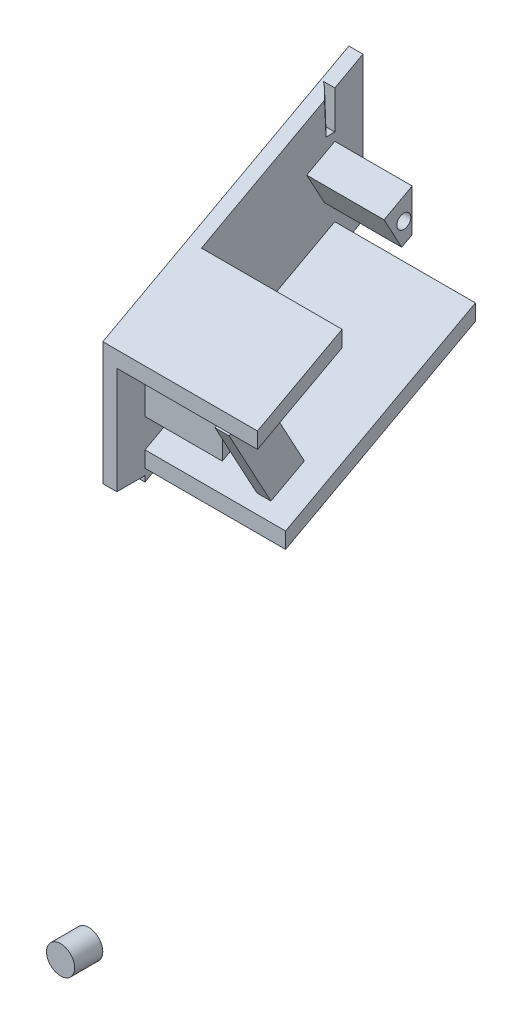
ISO-10303-21;
HEADER;
FILE_DESCRIPTION(('STEP AP214'),'2;1');
FILE_NAME('part.step','',(''),(''),'','','');
FILE_SCHEMA(('AUTOMOTIVE_DESIGN { 1 0 10303 214 1 1 1 1 }'));
ENDSEC;
DATA;
#1=APPLICATION_CONTEXT('core data for automotive mechanical design processes');
#2=APPLICATION_PROTOCOL_DEFINITION('international standard','automotive_design',2000,#1);
#3=PRODUCT_CONTEXT('',#1,'mechanical');
#4=PRODUCT('Part','Part','',(#3));
#5=PRODUCT_RELATED_PRODUCT_CATEGORY('part','',(#4));
#6=PRODUCT_DEFINITION_FORMATION('','',#4);
#7=PRODUCT_DEFINITION_CONTEXT('part definition',#1,'design');
#8=PRODUCT_DEFINITION('design','',#6,#7);
#9=PRODUCT_DEFINITION_SHAPE('','',#8);
#10=(LENGTH_UNIT() NAMED_UNIT(*) SI_UNIT(.MILLI.,.METRE.));
#11=(NAMED_UNIT(*) PLANE_ANGLE_UNIT() SI_UNIT($,.RADIAN.));
#12=(NAMED_UNIT(*) SI_UNIT($,.STERADIAN.) SOLID_ANGLE_UNIT());
#13=UNCERTAINTY_MEASURE_WITH_UNIT(LENGTH_MEASURE(1.E-05),#10,'distance_accuracy_value','');
#14=(GEOMETRIC_REPRESENTATION_CONTEXT(3) GLOBAL_UNCERTAINTY_ASSIGNED_CONTEXT((#13)) GLOBAL_UNIT_ASSIGNED_CONTEXT((#10,
#11,#12)) REPRESENTATION_CONTEXT('',''));
#15=CARTESIAN_POINT('',(0.,0.,0.));
#16=DIRECTION('',(0.,0.,1.));
#17=DIRECTION('',(1.,0.,0.));
#18=AXIS2_PLACEMENT_3D('',#15,#16,#17);
#19=CARTESIAN_POINT('',(8.,0.,7.));
#20=DIRECTION('',(-1.,0.,0.));
#21=DIRECTION('',(0.,-1.,0.));
#22=AXIS2_PLACEMENT_3D('',#19,#20,#21);
#23=PLANE('',#22);
#24=DIRECTION('',(0.,0.879716686463005,0.475498214043492));
#25=VECTOR('',#24,1.);
#26=CARTESIAN_POINT('',(8.00000000000001,95.1398047539169,26.7593521727643));
#27=LINE('',#26,#25);
#28=CARTESIAN_POINT('',(8.00000000000001,90.4963960632682,24.2495298930997));
#29=VERTEX_POINT('',#28);
#30=CARTESIAN_POINT('',(8.00000000000001,95.1398047539169,26.7593521727643));
#31=VERTEX_POINT('',#30);
#32=EDGE_CURVE('E684',#29,#31,#27,.T.);
#33=ORIENTED_EDGE('',*,*,#32,.F.);
#34=DIRECTION('',(0.,0.475498214043486,-0.879716686463009));
#35=VECTOR('',#34,1.);
#36=CARTESIAN_POINT('',(8.00000000000001,89.8306985636073,25.481133254148));
#37=LINE('',#36,#35);
#38=CARTESIAN_POINT('',(8.00000000000001,87.9287057074334,29.));
#39=VERTEX_POINT('',#38);
#40=EDGE_CURVE('E501',#39,#29,#37,.T.);
#41=ORIENTED_EDGE('',*,*,#40,.F.);
#42=DIRECTION('',(0.,-1.,0.));
#43=VECTOR('',#42,1.);
#44=CARTESIAN_POINT('',(8.00000000000001,93.9287057074334,29.));
#45=LINE('',#44,#43);
#46=CARTESIAN_POINT('',(8.00000000000001,93.9287057074334,29.));
#47=VERTEX_POINT('',#46);
#48=EDGE_CURVE('E495',#47,#39,#45,.T.);
#49=ORIENTED_EDGE('',*,*,#48,.F.);
#50=DIRECTION('',(0.,-0.475498214043486,0.879716686463008));
#51=VECTOR('',#50,1.);
#52=CARTESIAN_POINT('',(8.00000000000001,93.9287057074334,29.));
#53=LINE('',#52,#51);
#54=EDGE_CURVE('E490',#31,#47,#53,.T.);
#55=ORIENTED_EDGE('',*,*,#54,.F.);
#56=EDGE_LOOP('',(#33,#41,#49,#55));
#57=FACE_BOUND('',#56,.T.);
#58=DIRECTION('',(0.,-1.,0.));
#59=VECTOR('',#58,1.);
#60=CARTESIAN_POINT('',(8.00000000000001,83.8241456869468,29.));
#61=LINE('',#60,#59);
#62=CARTESIAN_POINT('',(8.00000000000001,83.8241456869468,29.));
#63=VERTEX_POINT('',#62);
#64=CARTESIAN_POINT('',(8.00000000000001,81.5506864803911,29.));
#65=VERTEX_POINT('',#64);
#66=EDGE_CURVE('E526',#63,#65,#61,.T.);
#67=ORIENTED_EDGE('',*,*,#66,.F.);
#68=DIRECTION('',(0.,-0.475498214043486,0.879716686463009));
#69=VECTOR('',#68,1.);
#70=CARTESIAN_POINT('',(8.00000000000001,83.8241456869468,29.));
#71=LINE('',#70,#69);
#72=CARTESIAN_POINT('',(8.00000000000001,98.4179938845892,2.));
#73=VERTEX_POINT('',#72);
#74=EDGE_CURVE('E542',#73,#63,#71,.T.);
#75=ORIENTED_EDGE('',*,*,#74,.F.);
#76=DIRECTION('',(0.,1.,0.));
#77=VECTOR('',#76,1.);
#78=CARTESIAN_POINT('',(8.00000000000001,96.1445346780335,2.));
#79=LINE('',#78,#77);
#80=CARTESIAN_POINT('',(8.00000000000001,96.1445346780335,2.));
#81=VERTEX_POINT('',#80);
#82=EDGE_CURVE('E537',#81,#73,#79,.T.);
#83=ORIENTED_EDGE('',*,*,#82,.F.);
#84=DIRECTION('',(0.,0.475498214043486,-0.879716686463009));
#85=VECTOR('',#84,1.);
#86=CARTESIAN_POINT('',(8.00000000000001,81.5506864803911,29.));
#87=LINE('',#86,#85);
#88=EDGE_CURVE('E532',#65,#81,#87,.T.);
#89=ORIENTED_EDGE('',*,*,#88,.F.);
#90=EDGE_LOOP('',(#67,#75,#83,#89));
#91=FACE_BOUND('',#90,.T.);
#92=DIRECTION('',(0.,1.,0.));
#93=VECTOR('',#92,1.);
#94=CARTESIAN_POINT('',(8.00000000000001,102.321671211559,2.));
#95=LINE('',#94,#93);
#96=CARTESIAN_POINT('',(8.00000000000001,102.321671211559,2.));
#97=VERTEX_POINT('',#96);
#98=CARTESIAN_POINT('',(8.00000000000001,108.321671211559,1.99999999999999));
#99=VERTEX_POINT('',#98);
#100=EDGE_CURVE('E463',#97,#99,#95,.T.);
#101=ORIENTED_EDGE('',*,*,#100,.F.);
#102=DIRECTION('',(0.,0.475498214043486,-0.879716686463008));
#103=VECTOR('',#102,1.);
#104=CARTESIAN_POINT('',(8.00000000000001,100.159619626723,6.));
#105=LINE('',#104,#103);
#106=CARTESIAN_POINT('',(8.00000000000001,101.516210936074,3.49017772033549));
#107=VERTEX_POINT('',#106);
#108=EDGE_CURVE('E457',#107,#97,#105,.T.);
#109=ORIENTED_EDGE('',*,*,#108,.F.);
#110=DIRECTION('',(0.,0.879716686463006,0.475498214043491));
#111=VECTOR('',#110,1.);
#112=CARTESIAN_POINT('',(8.00000000000001,106.159619626723,6.));
#113=LINE('',#112,#111);
#114=CARTESIAN_POINT('',(8.00000000000001,106.159619626723,6.));
#115=VERTEX_POINT('',#114);
#116=EDGE_CURVE('E710',#107,#115,#113,.T.);
#117=ORIENTED_EDGE('',*,*,#116,.T.);
#118=DIRECTION('',(0.,-0.475498214043486,0.879716686463008));
#119=VECTOR('',#118,1.);
#120=CARTESIAN_POINT('',(8.00000000000001,108.321671211559,2.));
#121=LINE('',#120,#119);
#122=EDGE_CURVE('E469',#99,#115,#121,.T.);
#123=ORIENTED_EDGE('',*,*,#122,.F.);
#124=EDGE_LOOP('',(#101,#109,#117,#123));
#125=FACE_BOUND('',#124,.T.);
#126=DIRECTION('',(0.,0.475498214043486,-0.879716686463008));
#127=VECTOR('',#126,1.);
#128=CARTESIAN_POINT('',(8.00000000000001,93.6227036654673,3.5));
#129=LINE('',#128,#127);
#130=CARTESIAN_POINT('',(8.00000000000001,79.8396248121383,29.));
#131=VERTEX_POINT('',#130);
#132=CARTESIAN_POINT('',(8.00000000000001,96.5955245946166,-2.));
#133=VERTEX_POINT('',#132);
#134=EDGE_CURVE('E368',#131,#133,#129,.T.);
#135=ORIENTED_EDGE('',*,*,#134,.T.);
#136=DIRECTION('',(0.,1.,0.));
#137=VECTOR('',#136,1.);
#138=CARTESIAN_POINT('',(8.00000000000001,93.6227036654673,-2.));
#139=LINE('',#138,#137);
#140=CARTESIAN_POINT('',(8.00000000000001,117.062624716954,-2.));
#141=VERTEX_POINT('',#140);
#142=EDGE_CURVE('E362',#133,#141,#139,.T.);
#143=ORIENTED_EDGE('',*,*,#142,.T.);
#144=DIRECTION('',(0.,-0.475498214043487,0.879716686463008));
#145=VECTOR('',#144,1.);
#146=CARTESIAN_POINT('',(8.00000000000001,89.7583274002542,48.5155335019852));
#147=LINE('',#146,#145);
#148=CARTESIAN_POINT('',(8.00000000000001,114.900573132118,2.));
#149=VERTEX_POINT('',#148);
#150=EDGE_CURVE('E345',#141,#149,#147,.T.);
#151=ORIENTED_EDGE('',*,*,#150,.T.);
#152=DIRECTION('',(0.,-1.,0.));
#153=VECTOR('',#152,1.);
#154=CARTESIAN_POINT('',(8.00000000000001,93.6227036654673,2.));
#155=LINE('',#154,#153);
#156=CARTESIAN_POINT('',(8.00000000000001,109.474229053552,2.));
#157=VERTEX_POINT('',#156);
#158=EDGE_CURVE('E370',#149,#157,#155,.T.);
#159=ORIENTED_EDGE('',*,*,#158,.T.);
#160=DIRECTION('',(0.,0.,1.));
#161=VECTOR('',#160,1.);
#162=CARTESIAN_POINT('',(8.,109.474229053552,2.));
#163=LINE('',#162,#161);
#164=CARTESIAN_POINT('',(8.,109.474229053552,3.25315614578327));
#165=VERTEX_POINT('',#164);
#166=EDGE_CURVE('E375',#157,#165,#163,.T.);
#167=ORIENTED_EDGE('',*,*,#166,.T.);
#168=CARTESIAN_POINT('',(8.,-75.1999200639359,10.));
#169=DIRECTION('',(-1.,0.,0.));
#170=DIRECTION('',(0.,1.,0.));
#171=AXIS2_PLACEMENT_3D('',#168,#169,#170);
#172=ELLIPSE('',#171,250.199920063936,10.);
#173=CARTESIAN_POINT('',(8.00000000000001,114.110535007947,3.46164528119833));
#174=VERTEX_POINT('',#173);
#175=EDGE_CURVE('E412',#165,#174,#172,.F.);
#176=ORIENTED_EDGE('',*,*,#175,.T.);
#177=CARTESIAN_POINT('',(8.00000000000001,104.650594806798,20.9634297298192));
#178=VERTEX_POINT('',#177);
#179=EDGE_CURVE('E357',#174,#178,#147,.T.);
#180=ORIENTED_EDGE('',*,*,#179,.T.);
#181=DIRECTION('',(0.,1.,0.));
#182=VECTOR('',#181,1.);
#183=CARTESIAN_POINT('',(8.00000000000001,102.377135600242,20.9634297298192));
#184=LINE('',#183,#182);
#185=CARTESIAN_POINT('',(8.00000000000001,102.377135600242,20.9634297298192));
#186=VERTEX_POINT('',#185);
#187=EDGE_CURVE('E575',#186,#178,#184,.T.);
#188=ORIENTED_EDGE('',*,*,#187,.F.);
#189=DIRECTION('',(0.,0.475498214043487,-0.879716686463008));
#190=VECTOR('',#189,1.);
#191=CARTESIAN_POINT('',(8.00000000000001,98.0332657279199,29.));
#192=LINE('',#191,#190);
#193=CARTESIAN_POINT('',(8.00000000000001,95.871214143084,33.));
#194=VERTEX_POINT('',#193);
#195=EDGE_CURVE('E570',#194,#186,#192,.T.);
#196=ORIENTED_EDGE('',*,*,#195,.F.);
#197=DIRECTION('',(0.,-1.,0.));
#198=VECTOR('',#197,1.);
#199=CARTESIAN_POINT('',(8.00000000000001,80.6503941564518,33.));
#200=LINE('',#199,#198);
#201=CARTESIAN_POINT('',(8.00000000000001,80.6503941564518,33.));
#202=VERTEX_POINT('',#201);
#203=EDGE_CURVE('E394',#194,#202,#200,.T.);
#204=ORIENTED_EDGE('',*,*,#203,.T.);
#205=DIRECTION('',(0.,0.,-1.));
#206=VECTOR('',#205,1.);
#207=CARTESIAN_POINT('',(8.00000000000001,80.6503941564518,29.));
#208=LINE('',#207,#206);
#209=CARTESIAN_POINT('',(8.00000000000001,80.6503941564518,29.));
#210=VERTEX_POINT('',#209);
#211=EDGE_CURVE('E377',#202,#210,#208,.T.);
#212=ORIENTED_EDGE('',*,*,#211,.T.);
#213=DIRECTION('',(0.,-1.,0.));
#214=VECTOR('',#213,1.);
#215=CARTESIAN_POINT('',(8.,0.,29.));
#216=LINE('',#215,#214);
#217=EDGE_CURVE('E371',#210,#131,#216,.T.);
#218=ORIENTED_EDGE('',*,*,#217,.T.);
#219=EDGE_LOOP('',(#135,#143,#151,#159,#167,#176,#180,#188,#196,#204,#212,#218));
#220=FACE_BOUND('',#219,.T.);
#221=ADVANCED_FACE('F146',(#57,#91,#125,#220),#23,.F.);
#222=CARTESIAN_POINT('',(5.00799041278211,-0.399680383488716,10.));
#223=DIRECTION('',(-0.0399680383488716,0.999200958721789,0.));
#224=DIRECTION('',(-0.999200958721789,-0.0399680383488716,0.));
#225=AXIS2_PLACEMENT_3D('',#222,#223,#224);
#226=CYLINDRICAL_SURFACE('',#225,10.);
#227=DIRECTION('',(-0.0399680383488716,0.999200958721789,0.));
#228=VECTOR('',#227,1.);
#229=CARTESIAN_POINT('',(11.0031961651129,-0.159872153395486,2.));
#230=LINE('',#229,#228);
#231=CARTESIAN_POINT('',(6.4007783536923,114.900573132118,2.));
#232=VERTEX_POINT('',#231);
#233=CARTESIAN_POINT('',(6.61783211683497,109.474229053552,2.));
#234=VERTEX_POINT('',#233);
#235=EDGE_CURVE('E381',#232,#234,#230,.F.);
#236=ORIENTED_EDGE('',*,*,#235,.F.);
#237=CARTESIAN_POINT('',(0.56894439894471,110.576469962446,10.));
#238=DIRECTION('',(0.,0.879716686463008,0.475498214043487));
#239=DIRECTION('',(-0.0838262150789779,0.4738246452998,-0.876620425938189));
#240=AXIS2_PLACEMENT_3D('',#237,#238,#239);
#241=ELLIPSE('',#240,11.3763862349771,10.);
#242=EDGE_CURVE('E657',#232,#174,#241,.F.);
#243=ORIENTED_EDGE('',*,*,#242,.T.);
#244=ORIENTED_EDGE('',*,*,#175,.F.);
#245=CARTESIAN_POINT('',(0.613034035300496,109.474229053552,10.));
#246=DIRECTION('',(0.,1.,0.));
#247=DIRECTION('',(-1.,0.,0.));
#248=AXIS2_PLACEMENT_3D('',#245,#246,#247);
#249=ELLIPSE('',#248,10.0079968025574,10.);
#250=EDGE_CURVE('E409',#234,#165,#249,.F.);
#251=ORIENTED_EDGE('',*,*,#250,.F.);
#252=EDGE_LOOP('',(#236,#243,#244,#251));
#253=FACE_BOUND('',#252,.T.);
#254=ADVANCED_FACE('F748',(#253),#226,.T.);
#255=CARTESIAN_POINT('',(0.,0.,29.));
#256=DIRECTION('',(0.,0.,1.));
#257=DIRECTION('',(1.,0.,0.));
#258=AXIS2_PLACEMENT_3D('',#255,#256,#257);
#259=PLANE('',#258);
#260=DIRECTION('',(0.,-1.,0.));
#261=VECTOR('',#260,1.);
#262=CARTESIAN_POINT('',(6.,31.5,29.));
#263=LINE('',#262,#261);
#264=CARTESIAN_POINT('',(6.00000000000001,80.6503941564518,29.));
#265=VERTEX_POINT('',#264);
#266=CARTESIAN_POINT('',(6.,79.8396248121384,29.));
#267=VERTEX_POINT('',#266);
#268=EDGE_CURVE('E411',#265,#267,#263,.T.);
#269=ORIENTED_EDGE('',*,*,#268,.T.);
#270=DIRECTION('',(1.,0.,0.));
#271=VECTOR('',#270,1.);
#272=CARTESIAN_POINT('',(0.,79.8396248121383,29.));
#273=LINE('',#272,#271);
#274=EDGE_CURVE('E654',#267,#131,#273,.T.);
#275=ORIENTED_EDGE('',*,*,#274,.T.);
#276=ORIENTED_EDGE('',*,*,#217,.F.);
#277=DIRECTION('',(1.,0.,0.));
#278=VECTOR('',#277,1.);
#279=CARTESIAN_POINT('',(6.00000000000001,80.6503941564518,29.));
#280=LINE('',#279,#278);
#281=EDGE_CURVE('E389',#265,#210,#280,.T.);
#282=ORIENTED_EDGE('',*,*,#281,.F.);
#283=EDGE_LOOP('',(#269,#275,#276,#282));
#284=FACE_BOUND('',#283,.T.);
#285=ADVANCED_FACE('F653',(#284),#259,.T.);
#286=CARTESIAN_POINT('',(6.,31.5,2.));
#287=DIRECTION('',(-1.,0.,0.));
#288=DIRECTION('',(0.,0.,1.));
#289=AXIS2_PLACEMENT_3D('',#286,#287,#288);
#290=PLANE('',#289);
#291=DIRECTION('',(0.,0.475498214043487,-0.879716686463008));
#292=VECTOR('',#291,1.);
#293=CARTESIAN_POINT('',(6.,96.0438243477936,36.8867694306296));
#294=LINE('',#293,#292);
#295=CARTESIAN_POINT('',(6.,98.1446733496397,33.));
#296=VERTEX_POINT('',#295);
#297=CARTESIAN_POINT('',(6.00000000000001,117.062624716954,-2.));
#298=VERTEX_POINT('',#297);
#299=EDGE_CURVE('E356',#296,#298,#294,.T.);
#300=ORIENTED_EDGE('',*,*,#299,.T.);
#301=DIRECTION('',(0.,1.,0.));
#302=VECTOR('',#301,1.);
#303=CARTESIAN_POINT('',(6.00000000000001,93.6227036654673,-2.));
#304=LINE('',#303,#302);
#305=CARTESIAN_POINT('',(6.00000000000001,96.5955245946166,-2.));
#306=VERTEX_POINT('',#305);
#307=EDGE_CURVE('E364',#306,#298,#304,.T.);
#308=ORIENTED_EDGE('',*,*,#307,.F.);
#309=DIRECTION('',(0.,0.475498214043486,-0.879716686463008));
#310=VECTOR('',#309,1.);
#311=CARTESIAN_POINT('',(6.00000000000001,93.6227036654673,3.5));
#312=LINE('',#311,#310);
#313=EDGE_CURVE('E162',#267,#306,#312,.T.);
#314=ORIENTED_EDGE('',*,*,#313,.F.);
#315=ORIENTED_EDGE('',*,*,#268,.F.);
#316=DIRECTION('',(0.,0.,-1.));
#317=VECTOR('',#316,1.);
#318=CARTESIAN_POINT('',(6.00000000000001,80.6503941564518,29.));
#319=LINE('',#318,#317);
#320=CARTESIAN_POINT('',(6.00000000000001,80.6503941564518,33.));
#321=VERTEX_POINT('',#320);
#322=EDGE_CURVE('E390',#321,#265,#319,.T.);
#323=ORIENTED_EDGE('',*,*,#322,.F.);
#324=DIRECTION('',(0.,-1.,0.));
#325=VECTOR('',#324,1.);
#326=CARTESIAN_POINT('',(6.00000000000001,80.6503941564518,33.));
#327=LINE('',#326,#325);
#328=EDGE_CURVE('E385',#296,#321,#327,.T.);
#329=ORIENTED_EDGE('',*,*,#328,.F.);
#330=EDGE_LOOP('',(#300,#308,#314,#315,#323,#329));
#331=FACE_BOUND('',#330,.T.);
#332=ADVANCED_FACE('F647',(#331),#290,.T.);
#333=CARTESIAN_POINT('',(6.00000000000001,80.6503941564518,33.));
#334=DIRECTION('',(0.,0.,1.));
#335=DIRECTION('',(1.,0.,0.));
#336=AXIS2_PLACEMENT_3D('',#333,#334,#335);
#337=PLANE('',#336);
#338=DIRECTION('',(-1.,0.,0.));
#339=VECTOR('',#338,1.);
#340=CARTESIAN_POINT('',(28.,98.1446733496397,33.));
#341=LINE('',#340,#339);
#342=CARTESIAN_POINT('',(28.,98.1446733496397,33.));
#343=VERTEX_POINT('',#342);
#344=EDGE_CURVE('E384',#343,#296,#341,.T.);
#345=ORIENTED_EDGE('',*,*,#344,.T.);
#346=ORIENTED_EDGE('',*,*,#328,.T.);
#347=DIRECTION('',(1.,0.,0.));
#348=VECTOR('',#347,1.);
#349=CARTESIAN_POINT('',(6.00000000000001,80.6503941564518,33.));
#350=LINE('',#349,#348);
#351=EDGE_CURVE('E388',#321,#202,#350,.T.);
#352=ORIENTED_EDGE('',*,*,#351,.T.);
#353=ORIENTED_EDGE('',*,*,#203,.F.);
#354=DIRECTION('',(-1.,0.,0.));
#355=VECTOR('',#354,1.);
#356=CARTESIAN_POINT('',(28.,95.871214143084,33.));
#357=LINE('',#356,#355);
#358=CARTESIAN_POINT('',(22.2,95.871214143084,33.));
#359=VERTEX_POINT('',#358);
#360=EDGE_CURVE('E574',#359,#194,#357,.T.);
#361=ORIENTED_EDGE('',*,*,#360,.F.);
#362=CARTESIAN_POINT('',(24.2,95.871214143084,33.));
#363=VERTEX_POINT('',#362);
#364=EDGE_CURVE('E584',#363,#359,#357,.T.);
#365=ORIENTED_EDGE('',*,*,#364,.F.);
#366=CARTESIAN_POINT('',(28.,95.871214143084,33.));
#367=VERTEX_POINT('',#366);
#368=EDGE_CURVE('E580',#367,#363,#357,.T.);
#369=ORIENTED_EDGE('',*,*,#368,.F.);
#370=DIRECTION('',(0.,-1.,0.));
#371=VECTOR('',#370,1.);
#372=CARTESIAN_POINT('',(28.,95.871214143084,33.));
#373=LINE('',#372,#371);
#374=EDGE_CURVE('E531',#343,#367,#373,.T.);
#375=ORIENTED_EDGE('',*,*,#374,.F.);
#376=EDGE_LOOP('',(#345,#346,#352,#353,#361,#365,#369,#375));
#377=FACE_BOUND('',#376,.T.);
#378=ADVANCED_FACE('F626',(#377),#337,.T.);
#379=CARTESIAN_POINT('',(6.00000000000001,93.6227036654673,2.));
#380=DIRECTION('',(0.,0.,1.));
#381=DIRECTION('',(1.,0.,0.));
#382=AXIS2_PLACEMENT_3D('',#379,#380,#381);
#383=PLANE('',#382);
#384=ORIENTED_EDGE('',*,*,#158,.F.);
#385=DIRECTION('',(-1.,0.,0.));
#386=VECTOR('',#385,1.);
#387=CARTESIAN_POINT('',(6.00000000000001,114.900573132118,2.));
#388=LINE('',#387,#386);
#389=EDGE_CURVE('E351',#149,#232,#388,.T.);
#390=ORIENTED_EDGE('',*,*,#389,.T.);
#391=ORIENTED_EDGE('',*,*,#235,.T.);
#392=DIRECTION('',(-1.,0.,0.));
#393=VECTOR('',#392,1.);
#394=CARTESIAN_POINT('',(6.,109.474229053552,2.));
#395=LINE('',#394,#393);
#396=EDGE_CURVE('E417',#157,#234,#395,.T.);
#397=ORIENTED_EDGE('',*,*,#396,.F.);
#398=EDGE_LOOP('',(#384,#390,#391,#397));
#399=FACE_BOUND('',#398,.T.);
#400=ADVANCED_FACE('F1041',(#399),#383,.T.);
#401=CARTESIAN_POINT('',(6.00000000000001,93.6227036654673,-2.));
#402=DIRECTION('',(0.,0.,-1.));
#403=DIRECTION('',(-1.,0.,0.));
#404=AXIS2_PLACEMENT_3D('',#401,#402,#403);
#405=PLANE('',#404);
#406=ORIENTED_EDGE('',*,*,#142,.F.);
#407=DIRECTION('',(-1.,0.,0.));
#408=VECTOR('',#407,1.);
#409=CARTESIAN_POINT('',(6.00000000000001,96.5955245946166,-2.));
#410=LINE('',#409,#408);
#411=EDGE_CURVE('E13',#133,#306,#410,.T.);
#412=ORIENTED_EDGE('',*,*,#411,.T.);
#413=ORIENTED_EDGE('',*,*,#307,.T.);
#414=DIRECTION('',(1.,0.,0.));
#415=VECTOR('',#414,1.);
#416=CARTESIAN_POINT('',(6.00000000000001,117.062624716954,-2.));
#417=LINE('',#416,#415);
#418=EDGE_CURVE('E155',#298,#141,#417,.T.);
#419=ORIENTED_EDGE('',*,*,#418,.T.);
#420=EDGE_LOOP('',(#406,#412,#413,#419));
#421=FACE_BOUND('',#420,.T.);
#422=ADVANCED_FACE('F361',(#421),#405,.T.);
#423=CARTESIAN_POINT('',(28.,98.0332657279199,29.));
#424=DIRECTION('',(0.,0.879716686463008,0.475498214043487));
#425=DIRECTION('',(0.,-0.475498214043487,0.879716686463008));
#426=AXIS2_PLACEMENT_3D('',#423,#424,#425);
#427=PLANE('',#426);
#428=DIRECTION('',(0.,-0.475498214043491,0.879716686463006));
#429=VECTOR('',#428,1.);
#430=CARTESIAN_POINT('',(22.2,98.3163296989863,28.4763048707038));
#431=LINE('',#430,#429);
#432=CARTESIAN_POINT('',(22.2,98.3163296989863,28.4763048707038));
#433=VERTEX_POINT('',#432);
#434=EDGE_CURVE('E612',#433,#359,#431,.T.);
#435=ORIENTED_EDGE('',*,*,#434,.T.);
#436=ORIENTED_EDGE('',*,*,#360,.T.);
#437=ORIENTED_EDGE('',*,*,#195,.T.);
#438=DIRECTION('',(-1.,0.,0.));
#439=VECTOR('',#438,1.);
#440=CARTESIAN_POINT('',(28.,102.377135600242,20.9634297298192));
#441=LINE('',#440,#439);
#442=CARTESIAN_POINT('',(28.,102.377135600242,20.9634297298192));
#443=VERTEX_POINT('',#442);
#444=EDGE_CURVE('E579',#443,#186,#441,.T.);
#445=ORIENTED_EDGE('',*,*,#444,.F.);
#446=DIRECTION('',(0.,0.475498214043484,-0.879716686463009));
#447=VECTOR('',#446,1.);
#448=CARTESIAN_POINT('',(28.,98.0332657279199,29.));
#449=LINE('',#448,#447);
#450=EDGE_CURVE('E558',#367,#443,#449,.T.);
#451=ORIENTED_EDGE('',*,*,#450,.F.);
#452=ORIENTED_EDGE('',*,*,#368,.T.);
#453=DIRECTION('',(0.,-0.475498214043491,0.879716686463006));
#454=VECTOR('',#453,1.);
#455=CARTESIAN_POINT('',(24.2,98.3163296989863,28.4763048707038));
#456=LINE('',#455,#454);
#457=CARTESIAN_POINT('',(24.2,98.3163296989863,28.4763048707038));
#458=VERTEX_POINT('',#457);
#459=EDGE_CURVE('E641',#458,#363,#456,.T.);
#460=ORIENTED_EDGE('',*,*,#459,.F.);
#461=DIRECTION('',(1.,0.,0.));
#462=VECTOR('',#461,1.);
#463=CARTESIAN_POINT('',(22.2,98.3163296989863,28.4763048707038));
#464=LINE('',#463,#462);
#465=EDGE_CURVE('E623',#433,#458,#464,.T.);
#466=ORIENTED_EDGE('',*,*,#465,.F.);
#467=EDGE_LOOP('',(#435,#436,#437,#445,#451,#452,#460,#466));
#468=FACE_BOUND('',#467,.T.);
#469=ADVANCED_FACE('F620',(#468),#427,.F.);
#470=CARTESIAN_POINT('',(28.,83.8241456869468,29.));
#471=DIRECTION('',(0.,-0.879716686463008,-0.475498214043486));
#472=DIRECTION('',(0.,0.475498214043486,-0.879716686463009));
#473=AXIS2_PLACEMENT_3D('',#470,#471,#472);
#474=PLANE('',#473);
#475=ORIENTED_EDGE('',*,*,#74,.T.);
#476=DIRECTION('',(-1.,0.,0.));
#477=VECTOR('',#476,1.);
#478=CARTESIAN_POINT('',(28.,83.8241456869468,29.));
#479=LINE('',#478,#477);
#480=CARTESIAN_POINT('',(28.,83.8241456869468,29.));
#481=VERTEX_POINT('',#480);
#482=EDGE_CURVE('E530',#481,#63,#479,.T.);
#483=ORIENTED_EDGE('',*,*,#482,.F.);
#484=DIRECTION('',(0.,-0.475498214043486,0.879716686463009));
#485=VECTOR('',#484,1.);
#486=CARTESIAN_POINT('',(28.,83.8241456869468,29.));
#487=LINE('',#486,#485);
#488=CARTESIAN_POINT('',(28.,98.4179938845892,2.));
#489=VERTEX_POINT('',#488);
#490=EDGE_CURVE('E500',#489,#481,#487,.T.);
#491=ORIENTED_EDGE('',*,*,#490,.F.);
#492=DIRECTION('',(-1.,0.,0.));
#493=VECTOR('',#492,1.);
#494=CARTESIAN_POINT('',(28.,98.4179938845892,2.));
#495=LINE('',#494,#493);
#496=EDGE_CURVE('E518',#489,#73,#495,.T.);
#497=ORIENTED_EDGE('',*,*,#496,.T.);
#498=EDGE_LOOP('',(#475,#483,#491,#497));
#499=FACE_BOUND('',#498,.T.);
#500=DIRECTION('',(0.,0.475498214043486,-0.879716686463009));
#501=VECTOR('',#500,1.);
#502=CARTESIAN_POINT('',(22.2,84.7521807623639,27.2830473020604));
#503=LINE('',#502,#501);
#504=CARTESIAN_POINT('',(22.2,84.7521807623639,27.2830473020604));
#505=VERTEX_POINT('',#504);
#506=CARTESIAN_POINT('',(22.2,87.3198711181987,22.5325771951602));
#507=VERTEX_POINT('',#506);
#508=EDGE_CURVE('E669',#505,#507,#503,.T.);
#509=ORIENTED_EDGE('',*,*,#508,.T.);
#510=DIRECTION('',(1.,0.,0.));
#511=VECTOR('',#510,1.);
#512=CARTESIAN_POINT('',(22.2,87.3198711181987,22.5325771951602));
#513=LINE('',#512,#511);
#514=CARTESIAN_POINT('',(24.2,87.3198711181987,22.5325771951602));
#515=VERTEX_POINT('',#514);
#516=EDGE_CURVE('E687',#507,#515,#513,.T.);
#517=ORIENTED_EDGE('',*,*,#516,.T.);
#518=DIRECTION('',(0.,0.475498214043486,-0.879716686463009));
#519=VECTOR('',#518,1.);
#520=CARTESIAN_POINT('',(24.2,84.7521807623639,27.2830473020604));
#521=LINE('',#520,#519);
#522=CARTESIAN_POINT('',(24.2,84.7521807623639,27.2830473020605));
#523=VERTEX_POINT('',#522);
#524=EDGE_CURVE('E661',#523,#515,#521,.T.);
#525=ORIENTED_EDGE('',*,*,#524,.F.);
#526=DIRECTION('',(1.,0.,0.));
#527=VECTOR('',#526,1.);
#528=CARTESIAN_POINT('',(22.2,84.7521807623639,27.2830473020604));
#529=LINE('',#528,#527);
#530=EDGE_CURVE('E625',#505,#523,#529,.T.);
#531=ORIENTED_EDGE('',*,*,#530,.F.);
#532=EDGE_LOOP('',(#509,#517,#525,#531));
#533=FACE_BOUND('',#532,.T.);
#534=ADVANCED_FACE('F765',(#499,#533),#474,.F.);
#535=CARTESIAN_POINT('',(6.,109.474229053552,2.));
#536=DIRECTION('',(0.,1.,0.));
#537=DIRECTION('',(0.,0.,1.));
#538=AXIS2_PLACEMENT_3D('',#535,#536,#537);
#539=PLANE('',#538);
#540=ORIENTED_EDGE('',*,*,#166,.F.);
#541=ORIENTED_EDGE('',*,*,#396,.T.);
#542=ORIENTED_EDGE('',*,*,#250,.T.);
#543=EDGE_LOOP('',(#540,#541,#542));
#544=FACE_BOUND('',#543,.T.);
#545=ADVANCED_FACE('F761',(#544),#539,.T.);
#546=CARTESIAN_POINT('',(6.00000000000001,93.6227036654673,3.5));
#547=DIRECTION('',(0.,-0.879716686463008,-0.475498214043486));
#548=DIRECTION('',(0.,0.475498214043486,-0.879716686463009));
#549=AXIS2_PLACEMENT_3D('',#546,#547,#548);
#550=PLANE('',#549);
#551=ORIENTED_EDGE('',*,*,#313,.T.);
#552=ORIENTED_EDGE('',*,*,#411,.F.);
#553=ORIENTED_EDGE('',*,*,#134,.F.);
#554=ORIENTED_EDGE('',*,*,#274,.F.);
#555=EDGE_LOOP('',(#551,#552,#553,#554));
#556=FACE_BOUND('',#555,.T.);
#557=ADVANCED_FACE('F764',(#556),#550,.T.);
#558=CARTESIAN_POINT('',(6.00000000000001,80.6503941564518,29.));
#559=DIRECTION('',(0.,-1.,0.));
#560=DIRECTION('',(1.,0.,0.));
#561=AXIS2_PLACEMENT_3D('',#558,#559,#560);
#562=PLANE('',#561);
#563=ORIENTED_EDGE('',*,*,#211,.F.);
#564=ORIENTED_EDGE('',*,*,#351,.F.);
#565=ORIENTED_EDGE('',*,*,#322,.T.);
#566=ORIENTED_EDGE('',*,*,#281,.T.);
#567=EDGE_LOOP('',(#563,#564,#565,#566));
#568=FACE_BOUND('',#567,.T.);
#569=ADVANCED_FACE('F650',(#568),#562,.T.);
#570=CARTESIAN_POINT('',(28.,102.377135600242,20.9634297298192));
#571=DIRECTION('',(0.,0.,1.));
#572=DIRECTION('',(1.,0.,0.));
#573=AXIS2_PLACEMENT_3D('',#570,#571,#572);
#574=PLANE('',#573);
#575=ORIENTED_EDGE('',*,*,#187,.T.);
#576=DIRECTION('',(-1.,0.,0.));
#577=VECTOR('',#576,1.);
#578=CARTESIAN_POINT('',(28.,104.650594806798,20.9634297298192));
#579=LINE('',#578,#577);
#580=CARTESIAN_POINT('',(28.,104.650594806798,20.9634297298192));
#581=VERTEX_POINT('',#580);
#582=EDGE_CURVE('E562',#581,#178,#579,.T.);
#583=ORIENTED_EDGE('',*,*,#582,.F.);
#584=DIRECTION('',(0.,1.,0.));
#585=VECTOR('',#584,1.);
#586=CARTESIAN_POINT('',(28.,102.377135600242,20.9634297298192));
#587=LINE('',#586,#585);
#588=EDGE_CURVE('E561',#443,#581,#587,.T.);
#589=ORIENTED_EDGE('',*,*,#588,.F.);
#590=ORIENTED_EDGE('',*,*,#444,.T.);
#591=EDGE_LOOP('',(#575,#583,#589,#590));
#592=FACE_BOUND('',#591,.T.);
#593=ADVANCED_FACE('F634',(#592),#574,.F.);
#594=CARTESIAN_POINT('',(28.,100.306724934476,29.));
#595=DIRECTION('',(0.,-0.879716686463008,-0.475498214043486));
#596=DIRECTION('',(0.,0.475498214043486,-0.879716686463008));
#597=AXIS2_PLACEMENT_3D('',#594,#595,#596);
#598=PLANE('',#597);
#599=ORIENTED_EDGE('',*,*,#418,.F.);
#600=ORIENTED_EDGE('',*,*,#299,.F.);
#601=ORIENTED_EDGE('',*,*,#344,.F.);
#602=DIRECTION('',(0.,-0.475498214043487,0.879716686463008));
#603=VECTOR('',#602,1.);
#604=CARTESIAN_POINT('',(28.,100.306724934476,29.));
#605=LINE('',#604,#603);
#606=EDGE_CURVE('E565',#581,#343,#605,.T.);
#607=ORIENTED_EDGE('',*,*,#606,.F.);
#608=ORIENTED_EDGE('',*,*,#582,.T.);
#609=ORIENTED_EDGE('',*,*,#179,.F.);
#610=ORIENTED_EDGE('',*,*,#242,.F.);
#611=ORIENTED_EDGE('',*,*,#389,.F.);
#612=ORIENTED_EDGE('',*,*,#150,.F.);
#613=EDGE_LOOP('',(#599,#600,#601,#607,#608,#609,#610,#611,#612));
#614=FACE_BOUND('',#613,.T.);
#615=ADVANCED_FACE('F347',(#614),#598,.F.);
#616=CARTESIAN_POINT('',(28.,0.,0.));
#617=DIRECTION('',(-1.,0.,0.));
#618=DIRECTION('',(0.,0.,1.));
#619=AXIS2_PLACEMENT_3D('',#616,#617,#618);
#620=PLANE('',#619);
#621=ORIENTED_EDGE('',*,*,#450,.T.);
#622=ORIENTED_EDGE('',*,*,#588,.T.);
#623=ORIENTED_EDGE('',*,*,#606,.T.);
#624=ORIENTED_EDGE('',*,*,#374,.T.);
#625=EDGE_LOOP('',(#621,#622,#623,#624));
#626=FACE_BOUND('',#625,.T.);
#627=ADVANCED_FACE('F638',(#626),#620,.F.);
#628=CARTESIAN_POINT('',(28.,83.8241456869468,29.));
#629=DIRECTION('',(0.,0.,-1.));
#630=DIRECTION('',(-1.,0.,0.));
#631=AXIS2_PLACEMENT_3D('',#628,#629,#630);
#632=PLANE('',#631);
#633=ORIENTED_EDGE('',*,*,#66,.T.);
#634=DIRECTION('',(-1.,0.,0.));
#635=VECTOR('',#634,1.);
#636=CARTESIAN_POINT('',(28.,81.5506864803911,29.));
#637=LINE('',#636,#635);
#638=CARTESIAN_POINT('',(28.,81.5506864803911,29.));
#639=VERTEX_POINT('',#638);
#640=EDGE_CURVE('E536',#639,#65,#637,.T.);
#641=ORIENTED_EDGE('',*,*,#640,.F.);
#642=DIRECTION('',(0.,-1.,0.));
#643=VECTOR('',#642,1.);
#644=CARTESIAN_POINT('',(28.,83.8241456869468,29.));
#645=LINE('',#644,#643);
#646=EDGE_CURVE('E513',#481,#639,#645,.T.);
#647=ORIENTED_EDGE('',*,*,#646,.F.);
#648=ORIENTED_EDGE('',*,*,#482,.T.);
#649=EDGE_LOOP('',(#633,#641,#647,#648));
#650=FACE_BOUND('',#649,.T.);
#651=ADVANCED_FACE('F903',(#650),#632,.F.);
#652=CARTESIAN_POINT('',(28.,81.5506864803911,29.));
#653=DIRECTION('',(0.,0.879716686463008,0.475498214043486));
#654=DIRECTION('',(0.,-0.475498214043486,0.879716686463009));
#655=AXIS2_PLACEMENT_3D('',#652,#653,#654);
#656=PLANE('',#655);
#657=ORIENTED_EDGE('',*,*,#88,.T.);
#658=DIRECTION('',(-1.,0.,0.));
#659=VECTOR('',#658,1.);
#660=CARTESIAN_POINT('',(28.,96.1445346780335,2.));
#661=LINE('',#660,#659);
#662=CARTESIAN_POINT('',(28.,96.1445346780335,2.));
#663=VERTEX_POINT('',#662);
#664=EDGE_CURVE('E541',#663,#81,#661,.T.);
#665=ORIENTED_EDGE('',*,*,#664,.F.);
#666=DIRECTION('',(0.,0.475498214043486,-0.879716686463009));
#667=VECTOR('',#666,1.);
#668=CARTESIAN_POINT('',(28.,81.5506864803911,29.));
#669=LINE('',#668,#667);
#670=EDGE_CURVE('E517',#639,#663,#669,.T.);
#671=ORIENTED_EDGE('',*,*,#670,.F.);
#672=ORIENTED_EDGE('',*,*,#640,.T.);
#673=EDGE_LOOP('',(#657,#665,#671,#672));
#674=FACE_BOUND('',#673,.T.);
#675=ADVANCED_FACE('F894',(#674),#656,.F.);
#676=CARTESIAN_POINT('',(28.,96.1445346780335,2.));
#677=DIRECTION('',(0.,0.,1.));
#678=DIRECTION('',(1.,0.,0.));
#679=AXIS2_PLACEMENT_3D('',#676,#677,#678);
#680=PLANE('',#679);
#681=ORIENTED_EDGE('',*,*,#82,.T.);
#682=ORIENTED_EDGE('',*,*,#496,.F.);
#683=DIRECTION('',(0.,1.,0.));
#684=VECTOR('',#683,1.);
#685=CARTESIAN_POINT('',(28.,96.1445346780335,2.));
#686=LINE('',#685,#684);
#687=EDGE_CURVE('E521',#663,#489,#686,.T.);
#688=ORIENTED_EDGE('',*,*,#687,.F.);
#689=ORIENTED_EDGE('',*,*,#664,.T.);
#690=EDGE_LOOP('',(#681,#682,#688,#689));
#691=FACE_BOUND('',#690,.T.);
#692=ADVANCED_FACE('F885',(#691),#680,.F.);
#693=CARTESIAN_POINT('',(28.,0.,0.));
#694=DIRECTION('',(1.,0.,0.));
#695=DIRECTION('',(0.,0.,-1.));
#696=AXIS2_PLACEMENT_3D('',#693,#694,#695);
#697=PLANE('',#696);
#698=ORIENTED_EDGE('',*,*,#646,.T.);
#699=ORIENTED_EDGE('',*,*,#670,.T.);
#700=ORIENTED_EDGE('',*,*,#687,.T.);
#701=ORIENTED_EDGE('',*,*,#490,.T.);
#702=EDGE_LOOP('',(#698,#699,#700,#701));
#703=FACE_BOUND('',#702,.T.);
#704=ADVANCED_FACE('F876',(#703),#697,.T.);
#705=CARTESIAN_POINT('',(19.,93.9287057074334,29.));
#706=DIRECTION('',(0.,0.,-1.));
#707=DIRECTION('',(-1.,0.,0.));
#708=AXIS2_PLACEMENT_3D('',#705,#706,#707);
#709=PLANE('',#708);
#710=ORIENTED_EDGE('',*,*,#48,.T.);
#711=DIRECTION('',(-1.,0.,0.));
#712=VECTOR('',#711,1.);
#713=CARTESIAN_POINT('',(19.,87.9287057074334,29.));
#714=LINE('',#713,#712);
#715=CARTESIAN_POINT('',(19.,87.9287057074334,29.));
#716=VERTEX_POINT('',#715);
#717=EDGE_CURVE('E504',#716,#39,#714,.T.);
#718=ORIENTED_EDGE('',*,*,#717,.F.);
#719=DIRECTION('',(0.,-1.,0.));
#720=VECTOR('',#719,1.);
#721=CARTESIAN_POINT('',(19.,93.9287057074334,29.));
#722=LINE('',#721,#720);
#723=CARTESIAN_POINT('',(19.,93.9287057074334,29.));
#724=VERTEX_POINT('',#723);
#725=EDGE_CURVE('E485',#724,#716,#722,.T.);
#726=ORIENTED_EDGE('',*,*,#725,.F.);
#727=DIRECTION('',(-1.,0.,0.));
#728=VECTOR('',#727,1.);
#729=CARTESIAN_POINT('',(19.,93.9287057074334,29.));
#730=LINE('',#729,#728);
#731=EDGE_CURVE('E499',#724,#47,#730,.T.);
#732=ORIENTED_EDGE('',*,*,#731,.T.);
#733=EDGE_LOOP('',(#710,#718,#726,#732));
#734=FACE_BOUND('',#733,.T.);
#735=ADVANCED_FACE('F866',(#734),#709,.F.);
#736=CARTESIAN_POINT('',(19.,89.8306985636073,25.481133254148));
#737=DIRECTION('',(0.,0.879716686463009,0.475498214043486));
#738=DIRECTION('',(0.,-0.475498214043486,0.879716686463009));
#739=AXIS2_PLACEMENT_3D('',#736,#737,#738);
#740=PLANE('',#739);
#741=ORIENTED_EDGE('',*,*,#40,.T.);
#742=DIRECTION('',(-1.,0.,0.));
#743=VECTOR('',#742,1.);
#744=CARTESIAN_POINT('',(19.,90.4963960632682,24.2495298930998));
#745=LINE('',#744,#743);
#746=CARTESIAN_POINT('',(19.,90.4963960632682,24.2495298930998));
#747=VERTEX_POINT('',#746);
#748=EDGE_CURVE('E705',#747,#29,#745,.T.);
#749=ORIENTED_EDGE('',*,*,#748,.F.);
#750=DIRECTION('',(0.,0.475498214043486,-0.879716686463009));
#751=VECTOR('',#750,1.);
#752=CARTESIAN_POINT('',(19.,89.8306985636073,25.481133254148));
#753=LINE('',#752,#751);
#754=EDGE_CURVE('E489',#716,#747,#753,.T.);
#755=ORIENTED_EDGE('',*,*,#754,.F.);
#756=ORIENTED_EDGE('',*,*,#717,.T.);
#757=EDGE_LOOP('',(#741,#749,#755,#756));
#758=FACE_BOUND('',#757,.T.);
#759=ADVANCED_FACE('F855',(#758),#740,.F.);
#760=CARTESIAN_POINT('',(19.,93.9287057074334,29.));
#761=DIRECTION('',(0.,-0.879716686463008,-0.475498214043486));
#762=DIRECTION('',(0.,0.475498214043486,-0.879716686463008));
#763=AXIS2_PLACEMENT_3D('',#760,#761,#762);
#764=PLANE('',#763);
#765=DIRECTION('',(0.,-0.475498214043486,0.879716686463008));
#766=VECTOR('',#765,1.);
#767=CARTESIAN_POINT('',(19.,93.9287057074334,29.));
#768=LINE('',#767,#766);
#769=CARTESIAN_POINT('',(19.,95.1398047539169,26.7593521727643));
#770=VERTEX_POINT('',#769);
#771=EDGE_CURVE('E468',#770,#724,#768,.T.);
#772=ORIENTED_EDGE('',*,*,#771,.F.);
#773=DIRECTION('',(-1.,0.,0.));
#774=VECTOR('',#773,1.);
#775=CARTESIAN_POINT('',(19.,95.1398047539169,26.7593521727643));
#776=LINE('',#775,#774);
#777=EDGE_CURVE('E698',#770,#31,#776,.T.);
#778=ORIENTED_EDGE('',*,*,#777,.T.);
#779=ORIENTED_EDGE('',*,*,#54,.T.);
#780=ORIENTED_EDGE('',*,*,#731,.F.);
#781=EDGE_LOOP('',(#772,#778,#779,#780));
#782=FACE_BOUND('',#781,.T.);
#783=ADVANCED_FACE('F744',(#782),#764,.F.);
#784=CARTESIAN_POINT('',(19.,0.,0.));
#785=DIRECTION('',(-1.,0.,0.));
#786=DIRECTION('',(0.,0.,1.));
#787=AXIS2_PLACEMENT_3D('',#784,#785,#786);
#788=PLANE('',#787);
#789=CARTESIAN_POINT('',(19.,91.5931230883034,27.7707649798365));
#790=DIRECTION('',(1.,0.,0.));
#791=DIRECTION('',(0.,0.,-1.));
#792=AXIS2_PLACEMENT_3D('',#789,#790,#791);
#793=CIRCLE('',#792,0.999999999999987);
#794=CARTESIAN_POINT('',(19.,91.5931230883034,26.7707649798365));
#795=VERTEX_POINT('',#794);
#796=EDGE_CURVE('E433',#795,#795,#793,.T.);
#797=ORIENTED_EDGE('',*,*,#796,.F.);
#798=EDGE_LOOP('',(#797));
#799=FACE_BOUND('',#798,.T.);
#800=ORIENTED_EDGE('',*,*,#754,.T.);
#801=DIRECTION('',(0.,0.879716686463005,0.475498214043492));
#802=VECTOR('',#801,1.);
#803=CARTESIAN_POINT('',(19.,95.1398047539169,26.7593521727643));
#804=LINE('',#803,#802);
#805=EDGE_CURVE('E694',#747,#770,#804,.T.);
#806=ORIENTED_EDGE('',*,*,#805,.T.);
#807=ORIENTED_EDGE('',*,*,#771,.T.);
#808=ORIENTED_EDGE('',*,*,#725,.T.);
#809=EDGE_LOOP('',(#800,#806,#807,#808));
#810=FACE_BOUND('',#809,.T.);
#811=ADVANCED_FACE('F737',(#799,#810),#788,.F.);
#812=CARTESIAN_POINT('',(19.,102.321671211559,2.));
#813=DIRECTION('',(0.,0.,1.));
#814=DIRECTION('',(1.,0.,0.));
#815=AXIS2_PLACEMENT_3D('',#812,#813,#814);
#816=PLANE('',#815);
#817=ORIENTED_EDGE('',*,*,#100,.T.);
#818=DIRECTION('',(-1.,0.,0.));
#819=VECTOR('',#818,1.);
#820=CARTESIAN_POINT('',(19.,108.321671211559,2.));
#821=LINE('',#820,#819);
#822=CARTESIAN_POINT('',(19.,108.321671211559,2.));
#823=VERTEX_POINT('',#822);
#824=EDGE_CURVE('E473',#823,#99,#821,.T.);
#825=ORIENTED_EDGE('',*,*,#824,.F.);
#826=DIRECTION('',(0.,1.,0.));
#827=VECTOR('',#826,1.);
#828=CARTESIAN_POINT('',(19.,102.321671211559,2.));
#829=LINE('',#828,#827);
#830=CARTESIAN_POINT('',(19.,102.321671211559,2.));
#831=VERTEX_POINT('',#830);
#832=EDGE_CURVE('E452',#831,#823,#829,.T.);
#833=ORIENTED_EDGE('',*,*,#832,.F.);
#834=DIRECTION('',(-1.,0.,0.));
#835=VECTOR('',#834,1.);
#836=CARTESIAN_POINT('',(19.,102.321671211559,2.));
#837=LINE('',#836,#835);
#838=EDGE_CURVE('E467',#831,#97,#837,.T.);
#839=ORIENTED_EDGE('',*,*,#838,.T.);
#840=EDGE_LOOP('',(#817,#825,#833,#839));
#841=FACE_BOUND('',#840,.T.);
#842=ADVANCED_FACE('F735',(#841),#816,.F.);
#843=CARTESIAN_POINT('',(19.,108.321671211559,2.));
#844=DIRECTION('',(0.,-0.879716686463008,-0.475498214043486));
#845=DIRECTION('',(0.,0.475498214043486,-0.879716686463008));
#846=AXIS2_PLACEMENT_3D('',#843,#844,#845);
#847=PLANE('',#846);
#848=ORIENTED_EDGE('',*,*,#122,.T.);
#849=DIRECTION('',(-1.,0.,0.));
#850=VECTOR('',#849,1.);
#851=CARTESIAN_POINT('',(19.,106.159619626723,6.));
#852=LINE('',#851,#850);
#853=CARTESIAN_POINT('',(19.,106.159619626723,6.));
#854=VERTEX_POINT('',#853);
#855=EDGE_CURVE('E476',#854,#115,#852,.T.);
#856=ORIENTED_EDGE('',*,*,#855,.F.);
#857=DIRECTION('',(0.,-0.475498214043486,0.879716686463008));
#858=VECTOR('',#857,1.);
#859=CARTESIAN_POINT('',(19.,108.321671211559,2.));
#860=LINE('',#859,#858);
#861=EDGE_CURVE('E456',#823,#854,#860,.T.);
#862=ORIENTED_EDGE('',*,*,#861,.F.);
#863=ORIENTED_EDGE('',*,*,#824,.T.);
#864=EDGE_LOOP('',(#848,#856,#862,#863));
#865=FACE_BOUND('',#864,.T.);
#866=ADVANCED_FACE('F726',(#865),#847,.F.);
#867=CARTESIAN_POINT('',(19.,100.159619626723,6.));
#868=DIRECTION('',(0.,0.879716686463008,0.475498214043486));
#869=DIRECTION('',(0.,-0.475498214043486,0.879716686463008));
#870=AXIS2_PLACEMENT_3D('',#867,#868,#869);
#871=PLANE('',#870);
#872=DIRECTION('',(0.,0.475498214043486,-0.879716686463008));
#873=VECTOR('',#872,1.);
#874=CARTESIAN_POINT('',(19.,100.159619626723,6.));
#875=LINE('',#874,#873);
#876=CARTESIAN_POINT('',(19.,101.516210936074,3.49017772033548));
#877=VERTEX_POINT('',#876);
#878=EDGE_CURVE('E447',#877,#831,#875,.T.);
#879=ORIENTED_EDGE('',*,*,#878,.F.);
#880=DIRECTION('',(1.,0.,0.));
#881=VECTOR('',#880,1.);
#882=CARTESIAN_POINT('',(8.00000000000001,101.516210936074,3.49017772033549));
#883=LINE('',#882,#881);
#884=EDGE_CURVE('E397',#107,#877,#883,.T.);
#885=ORIENTED_EDGE('',*,*,#884,.F.);
#886=ORIENTED_EDGE('',*,*,#108,.T.);
#887=ORIENTED_EDGE('',*,*,#838,.F.);
#888=EDGE_LOOP('',(#879,#885,#886,#887));
#889=FACE_BOUND('',#888,.T.);
#890=ADVANCED_FACE('F731',(#889),#871,.F.);
#891=CARTESIAN_POINT('',(19.,0.,0.));
#892=DIRECTION('',(1.,0.,0.));
#893=DIRECTION('',(0.,1.,0.));
#894=AXIS2_PLACEMENT_3D('',#891,#892,#893);
#895=PLANE('',#894);
#896=DIRECTION('',(0.,0.879716686463006,0.475498214043491));
#897=VECTOR('',#896,1.);
#898=CARTESIAN_POINT('',(19.,106.159619626723,6.));
#899=LINE('',#898,#897);
#900=EDGE_CURVE('E709',#877,#854,#899,.T.);
#901=ORIENTED_EDGE('',*,*,#900,.F.);
#902=ORIENTED_EDGE('',*,*,#878,.T.);
#903=ORIENTED_EDGE('',*,*,#832,.T.);
#904=ORIENTED_EDGE('',*,*,#861,.T.);
#905=EDGE_LOOP('',(#901,#902,#903,#904));
#906=FACE_BOUND('',#905,.T.);
#907=CARTESIAN_POINT('',(19.,104.565432597319,3.18297967895376));
#908=DIRECTION('',(1.,0.,0.));
#909=DIRECTION('',(0.,0.,-1.));
#910=AXIS2_PLACEMENT_3D('',#907,#908,#909);
#911=CIRCLE('',#910,0.999999999999987);
#912=CARTESIAN_POINT('',(19.,104.565432597319,2.18297967895377));
#913=VERTEX_POINT('',#912);
#914=EDGE_CURVE('E436',#913,#913,#911,.T.);
#915=ORIENTED_EDGE('',*,*,#914,.F.);
#916=EDGE_LOOP('',(#915));
#917=FACE_BOUND('',#916,.T.);
#918=ADVANCED_FACE('F721',(#906,#917),#895,.T.);
#919=CARTESIAN_POINT('',(11.,104.565432597319,3.18297967895376));
#920=DIRECTION('',(1.,0.,0.));
#921=DIRECTION('',(0.,0.,-1.));
#922=AXIS2_PLACEMENT_3D('',#919,#920,#921);
#923=CONICAL_SURFACE('',#922,1.,1.02974425867665);
#924=CARTESIAN_POINT('',(10.3991393809724,104.565432597319,3.18297967895376));
#925=VERTEX_POINT('',#924);
#926=VERTEX_LOOP('',#925);
#927=FACE_BOUND('',#926,.T.);
#928=CARTESIAN_POINT('',(11.,104.565432597319,3.18297967895376));
#929=DIRECTION('',(1.,0.,0.));
#930=DIRECTION('',(0.,0.,-1.));
#931=AXIS2_PLACEMENT_3D('',#928,#929,#930);
#932=CIRCLE('',#931,1.);
#933=CARTESIAN_POINT('',(11.,104.565432597319,2.18297967895376));
#934=VERTEX_POINT('',#933);
#935=EDGE_CURVE('E441',#934,#934,#932,.T.);
#936=ORIENTED_EDGE('',*,*,#935,.T.);
#937=EDGE_LOOP('',(#936));
#938=FACE_BOUND('',#937,.T.);
#939=ADVANCED_FACE('F784',(#927,#938),#923,.F.);
#940=CARTESIAN_POINT('',(19.,104.565432597319,3.18297967895376));
#941=DIRECTION('',(1.,0.,0.));
#942=DIRECTION('',(0.,0.,-1.));
#943=AXIS2_PLACEMENT_3D('',#940,#941,#942);
#944=CYLINDRICAL_SURFACE('',#943,0.999999999999994);
#945=ORIENTED_EDGE('',*,*,#935,.F.);
#946=EDGE_LOOP('',(#945));
#947=FACE_BOUND('',#946,.T.);
#948=ORIENTED_EDGE('',*,*,#914,.T.);
#949=EDGE_LOOP('',(#948));
#950=FACE_BOUND('',#949,.T.);
#951=ADVANCED_FACE('F777',(#947,#950),#944,.F.);
#952=CARTESIAN_POINT('',(19.,91.5931230883034,27.7707649798365));
#953=DIRECTION('',(1.,0.,0.));
#954=DIRECTION('',(0.,0.,-1.));
#955=AXIS2_PLACEMENT_3D('',#952,#953,#954);
#956=CYLINDRICAL_SURFACE('',#955,0.999999999999994);
#957=CARTESIAN_POINT('',(11.,91.5931230883034,27.7707649798365));
#958=DIRECTION('',(1.,0.,0.));
#959=DIRECTION('',(0.,0.,-1.));
#960=AXIS2_PLACEMENT_3D('',#957,#958,#959);
#961=CIRCLE('',#960,1.);
#962=CARTESIAN_POINT('',(11.,91.5931230883034,26.7707649798365));
#963=VERTEX_POINT('',#962);
#964=EDGE_CURVE('E366',#963,#963,#961,.T.);
#965=ORIENTED_EDGE('',*,*,#964,.F.);
#966=EDGE_LOOP('',(#965));
#967=FACE_BOUND('',#966,.T.);
#968=ORIENTED_EDGE('',*,*,#796,.T.);
#969=EDGE_LOOP('',(#968));
#970=FACE_BOUND('',#969,.T.);
#971=ADVANCED_FACE('F148',(#967,#970),#956,.F.);
#972=CARTESIAN_POINT('',(11.,91.5931230883034,27.7707649798365));
#973=DIRECTION('',(1.,0.,0.));
#974=DIRECTION('',(0.,0.,-1.));
#975=AXIS2_PLACEMENT_3D('',#972,#973,#974);
#976=CONICAL_SURFACE('',#975,1.,1.02974425867665);
#977=CARTESIAN_POINT('',(10.3991393809724,91.5931230883034,27.7707649798365));
#978=VERTEX_POINT('',#977);
#979=VERTEX_LOOP('',#978);
#980=FACE_BOUND('',#979,.T.);
#981=ORIENTED_EDGE('',*,*,#964,.T.);
#982=EDGE_LOOP('',(#981));
#983=FACE_BOUND('',#982,.T.);
#984=ADVANCED_FACE('F768',(#980,#983),#976,.F.);
#985=CARTESIAN_POINT('',(8.00000000000001,106.159619626723,6.));
#986=DIRECTION('',(0.,0.475498214043491,-0.879716686463006));
#987=DIRECTION('',(0.,0.879716686463006,0.475498214043491));
#988=AXIS2_PLACEMENT_3D('',#985,#986,#987);
#989=PLANE('',#988);
#990=ORIENTED_EDGE('',*,*,#900,.T.);
#991=ORIENTED_EDGE('',*,*,#855,.T.);
#992=ORIENTED_EDGE('',*,*,#116,.F.);
#993=ORIENTED_EDGE('',*,*,#884,.T.);
#994=EDGE_LOOP('',(#990,#991,#992,#993));
#995=FACE_BOUND('',#994,.T.);
#996=ADVANCED_FACE('F716',(#995),#989,.F.);
#997=CARTESIAN_POINT('',(19.,95.1398047539169,26.7593521727643));
#998=DIRECTION('',(0.,-0.475498214043492,0.879716686463005));
#999=DIRECTION('',(0.,-0.879716686463005,-0.475498214043492));
#1000=AXIS2_PLACEMENT_3D('',#997,#998,#999);
#1001=PLANE('',#1000);
#1002=ORIENTED_EDGE('',*,*,#32,.T.);
#1003=ORIENTED_EDGE('',*,*,#777,.F.);
#1004=ORIENTED_EDGE('',*,*,#805,.F.);
#1005=ORIENTED_EDGE('',*,*,#748,.T.);
#1006=EDGE_LOOP('',(#1002,#1003,#1004,#1005));
#1007=FACE_BOUND('',#1006,.T.);
#1008=ADVANCED_FACE('F775',(#1007),#1001,.F.);
#1009=CARTESIAN_POINT('',(22.2,98.3163296989863,28.4763048707038));
#1010=DIRECTION('',(0.,0.879716686463006,0.475498214043491));
#1011=DIRECTION('',(0.,-0.475498214043491,0.879716686463006));
#1012=AXIS2_PLACEMENT_3D('',#1009,#1010,#1011);
#1013=PLANE('',#1012);
#1014=CARTESIAN_POINT('',(24.2,95.7486393431515,33.226774977604));
#1015=VERTEX_POINT('',#1014);
#1016=EDGE_CURVE('E602',#363,#1015,#456,.T.);
#1017=ORIENTED_EDGE('',*,*,#1016,.F.);
#1018=ORIENTED_EDGE('',*,*,#364,.T.);
#1019=CARTESIAN_POINT('',(22.2,95.7486393431515,33.226774977604));
#1020=VERTEX_POINT('',#1019);
#1021=EDGE_CURVE('E600',#359,#1020,#431,.T.);
#1022=ORIENTED_EDGE('',*,*,#1021,.T.);
#1023=DIRECTION('',(1.,0.,0.));
#1024=VECTOR('',#1023,1.);
#1025=CARTESIAN_POINT('',(22.2,95.7486393431515,33.226774977604));
#1026=LINE('',#1025,#1024);
#1027=EDGE_CURVE('E681',#1020,#1015,#1026,.T.);
#1028=ORIENTED_EDGE('',*,*,#1027,.T.);
#1029=EDGE_LOOP('',(#1017,#1018,#1022,#1028));
#1030=FACE_BOUND('',#1029,.T.);
#1031=ADVANCED_FACE('F598',(#1030),#1013,.T.);
#1032=CARTESIAN_POINT('',(22.2,90.4963960632682,24.2495298930998));
#1033=DIRECTION('',(0.,0.475498214043487,-0.879716686463008));
#1034=DIRECTION('',(0.,0.879716686463008,0.475498214043487));
#1035=AXIS2_PLACEMENT_3D('',#1032,#1033,#1034);
#1036=PLANE('',#1035);
#1037=DIRECTION('',(0.,0.879716686463008,0.475498214043487));
#1038=VECTOR('',#1037,1.);
#1039=CARTESIAN_POINT('',(24.2,90.4963960632682,24.2495298930998));
#1040=LINE('',#1039,#1038);
#1041=EDGE_CURVE('E169',#515,#458,#1040,.T.);
#1042=ORIENTED_EDGE('',*,*,#1041,.F.);
#1043=ORIENTED_EDGE('',*,*,#516,.F.);
#1044=DIRECTION('',(0.,0.879716686463006,0.475498214043491));
#1045=VECTOR('',#1044,1.);
#1046=CARTESIAN_POINT('',(22.2,87.3198711181987,22.5325771951602));
#1047=LINE('',#1046,#1045);
#1048=EDGE_CURVE('E617',#507,#433,#1047,.T.);
#1049=ORIENTED_EDGE('',*,*,#1048,.T.);
#1050=ORIENTED_EDGE('',*,*,#465,.T.);
#1051=EDGE_LOOP('',(#1042,#1043,#1049,#1050));
#1052=FACE_BOUND('',#1051,.T.);
#1053=ADVANCED_FACE('F1007',(#1052),#1036,.T.);
#1054=CARTESIAN_POINT('',(22.2,87.9287057074334,29.));
#1055=DIRECTION('',(0.,-0.475498214043487,0.879716686463008));
#1056=DIRECTION('',(0.,-0.879716686463008,-0.475498214043487));
#1057=AXIS2_PLACEMENT_3D('',#1054,#1055,#1056);
#1058=PLANE('',#1057);
#1059=DIRECTION('',(0.,-0.879716686463008,-0.475498214043487));
#1060=VECTOR('',#1059,1.);
#1061=CARTESIAN_POINT('',(24.2,87.9287057074334,29.));
#1062=LINE('',#1061,#1060);
#1063=EDGE_CURVE('E656',#1015,#523,#1062,.T.);
#1064=ORIENTED_EDGE('',*,*,#1063,.F.);
#1065=ORIENTED_EDGE('',*,*,#1027,.F.);
#1066=DIRECTION('',(0.,-0.879716686463008,-0.475498214043486));
#1067=VECTOR('',#1066,1.);
#1068=CARTESIAN_POINT('',(22.2,87.9287057074334,29.));
#1069=LINE('',#1068,#1067);
#1070=EDGE_CURVE('E615',#1020,#505,#1069,.T.);
#1071=ORIENTED_EDGE('',*,*,#1070,.T.);
#1072=ORIENTED_EDGE('',*,*,#530,.T.);
#1073=EDGE_LOOP('',(#1064,#1065,#1071,#1072));
#1074=FACE_BOUND('',#1073,.T.);
#1075=ADVANCED_FACE('F1013',(#1074),#1058,.T.);
#1076=CARTESIAN_POINT('',(22.2,0.,0.));
#1077=DIRECTION('',(1.,0.,0.));
#1078=DIRECTION('',(0.,0.,-1.));
#1079=AXIS2_PLACEMENT_3D('',#1076,#1077,#1078);
#1080=PLANE('',#1079);
#1081=ORIENTED_EDGE('',*,*,#1070,.F.);
#1082=ORIENTED_EDGE('',*,*,#1021,.F.);
#1083=ORIENTED_EDGE('',*,*,#434,.F.);
#1084=ORIENTED_EDGE('',*,*,#1048,.F.);
#1085=ORIENTED_EDGE('',*,*,#508,.F.);
#1086=EDGE_LOOP('',(#1081,#1082,#1083,#1084,#1085));
#1087=FACE_BOUND('',#1086,.T.);
#1088=ADVANCED_FACE('F610',(#1087),#1080,.F.);
#1089=CARTESIAN_POINT('',(24.2,0.,0.));
#1090=DIRECTION('',(1.,0.,0.));
#1091=DIRECTION('',(0.,0.,-1.));
#1092=AXIS2_PLACEMENT_3D('',#1089,#1090,#1091);
#1093=PLANE('',#1092);
#1094=ORIENTED_EDGE('',*,*,#459,.T.);
#1095=ORIENTED_EDGE('',*,*,#1016,.T.);
#1096=ORIENTED_EDGE('',*,*,#1063,.T.);
#1097=ORIENTED_EDGE('',*,*,#524,.T.);
#1098=ORIENTED_EDGE('',*,*,#1041,.T.);
#1099=EDGE_LOOP('',(#1094,#1095,#1096,#1097,#1098));
#1100=FACE_BOUND('',#1099,.T.);
#1101=ADVANCED_FACE('F1028',(#1100),#1093,.T.);
#1102=CLOSED_SHELL('',(#221,#254,#285,#332,#378,#400,#422,#469,#534,#545,#557,#569,#593,#615,
#627,#651,#675,#692,#704,#735,#759,#783,#811,#842,#866,#890,#918,#939,#951,#971,#984,#996,#1008,
#1031,#1053,#1075,#1088,#1101));
#1103=MANIFOLD_SOLID_BREP('B2',#1102);
#1104=CARTESIAN_POINT('',(0.,19.,33.));
#1105=DIRECTION('',(0.,0.,-1.));
#1106=DIRECTION('',(-1.,0.,0.));
#1107=AXIS2_PLACEMENT_3D('',#1104,#1105,#1106);
#1108=CYLINDRICAL_SURFACE('',#1107,2.);
#1109=CARTESIAN_POINT('',(0.,19.,33.));
#1110=DIRECTION('',(0.,0.,1.));
#1111=DIRECTION('',(1.,0.,0.));
#1112=AXIS2_PLACEMENT_3D('',#1109,#1110,#1111);
#1113=CIRCLE('',#1112,2.);
#1114=CARTESIAN_POINT('',(2.,19.,33.));
#1115=VERTEX_POINT('',#1114);
#1116=EDGE_CURVE('E145',#1115,#1115,#1113,.T.);
#1117=ORIENTED_EDGE('',*,*,#1116,.F.);
#1118=EDGE_LOOP('',(#1117));
#1119=FACE_BOUND('',#1118,.T.);
#1120=CARTESIAN_POINT('',(0.,19.,29.));
#1121=DIRECTION('',(0.,0.,1.));
#1122=DIRECTION('',(1.,0.,0.));
#1123=AXIS2_PLACEMENT_3D('',#1120,#1121,#1122);
#1124=CIRCLE('',#1123,2.);
#1125=CARTESIAN_POINT('',(2.,19.,29.));
#1126=VERTEX_POINT('',#1125);
#1127=EDGE_CURVE('E1262',#1126,#1126,#1124,.T.);
#1128=ORIENTED_EDGE('',*,*,#1127,.T.);
#1129=EDGE_LOOP('',(#1128));
#1130=FACE_BOUND('',#1129,.T.);
#1131=ADVANCED_FACE('F1259',(#1119,#1130),#1108,.T.);
#1132=CARTESIAN_POINT('',(0.,19.,33.));
#1133=DIRECTION('',(0.,0.,1.));
#1134=DIRECTION('',(1.,0.,0.));
#1135=AXIS2_PLACEMENT_3D('',#1132,#1133,#1134);
#1136=PLANE('',#1135);
#1137=ORIENTED_EDGE('',*,*,#1116,.T.);
#1138=EDGE_LOOP('',(#1137));
#1139=FACE_BOUND('',#1138,.T.);
#1140=ADVANCED_FACE('F1274',(#1139),#1136,.T.);
#1141=CARTESIAN_POINT('',(0.,19.,29.));
#1142=DIRECTION('',(0.,0.,1.));
#1143=DIRECTION('',(1.,0.,0.));
#1144=AXIS2_PLACEMENT_3D('',#1141,#1142,#1143);
#1145=PLANE('',#1144);
#1146=ORIENTED_EDGE('',*,*,#1127,.F.);
#1147=EDGE_LOOP('',(#1146));
#1148=FACE_BOUND('',#1147,.T.);
#1149=ADVANCED_FACE('F1272',(#1148),#1145,.F.);
#1150=CLOSED_SHELL('',(#1131,#1140,#1149));
#1151=MANIFOLD_SOLID_BREP('B7_NOT_SHOWN',#1150);
#1152=ADVANCED_BREP_SHAPE_REPRESENTATION('',(#18,#1103,#1151),#14);
#1153=SHAPE_DEFINITION_REPRESENTATION(#9,#1152);
ENDSEC;
END-ISO-10303-21;
